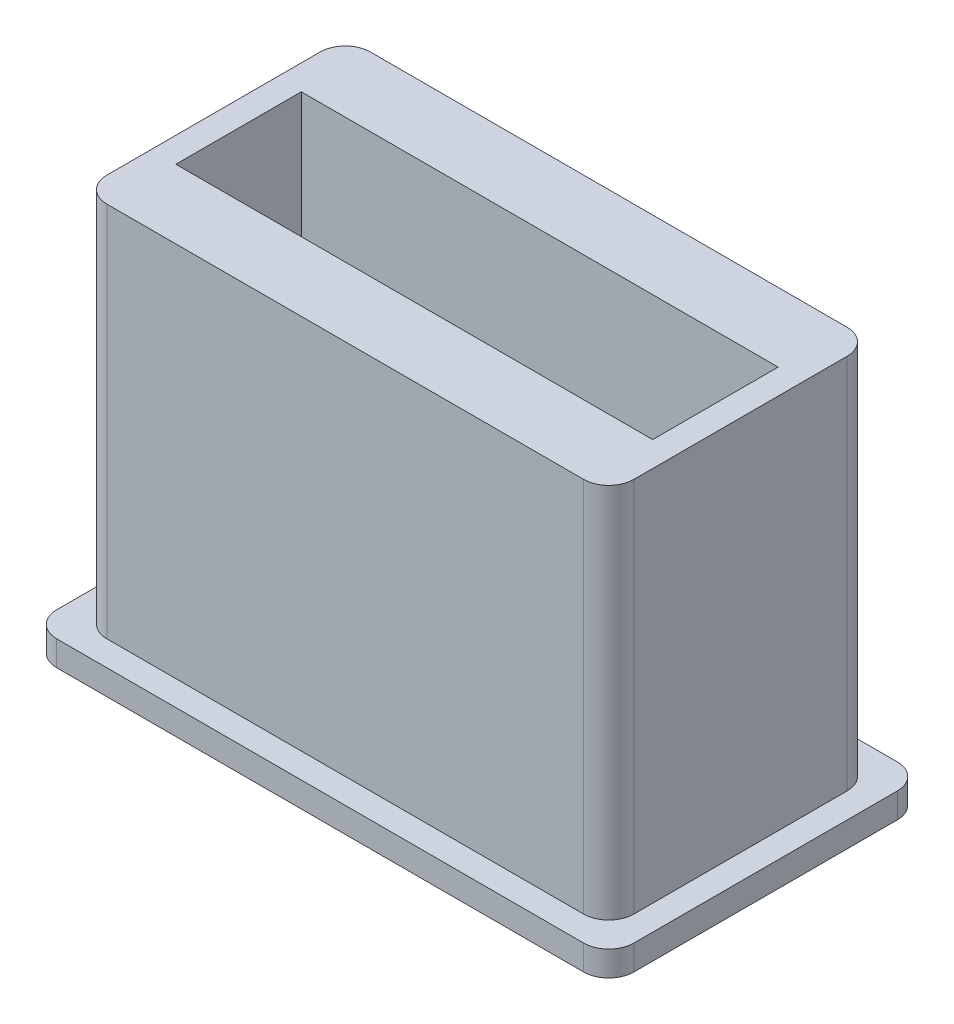
ISO-10303-21;
HEADER;
FILE_DESCRIPTION(('STEP AP214'),'2;1');
FILE_NAME('part.step','',(''),(''),'','','');
FILE_SCHEMA(('AUTOMOTIVE_DESIGN { 1 0 10303 214 1 1 1 1 }'));
ENDSEC;
DATA;
#1=APPLICATION_CONTEXT('core data for automotive mechanical design processes');
#2=APPLICATION_PROTOCOL_DEFINITION('international standard','automotive_design',2000,#1);
#3=PRODUCT_CONTEXT('',#1,'mechanical');
#4=PRODUCT('Part','Part','',(#3));
#5=PRODUCT_RELATED_PRODUCT_CATEGORY('part','',(#4));
#6=PRODUCT_DEFINITION_FORMATION('','',#4);
#7=PRODUCT_DEFINITION_CONTEXT('part definition',#1,'design');
#8=PRODUCT_DEFINITION('design','',#6,#7);
#9=PRODUCT_DEFINITION_SHAPE('','',#8);
#10=(LENGTH_UNIT() NAMED_UNIT(*) SI_UNIT(.MILLI.,.METRE.));
#11=(NAMED_UNIT(*) PLANE_ANGLE_UNIT() SI_UNIT($,.RADIAN.));
#12=(NAMED_UNIT(*) SI_UNIT($,.STERADIAN.) SOLID_ANGLE_UNIT());
#13=UNCERTAINTY_MEASURE_WITH_UNIT(LENGTH_MEASURE(1.E-05),#10,'distance_accuracy_value','');
#14=(GEOMETRIC_REPRESENTATION_CONTEXT(3) GLOBAL_UNCERTAINTY_ASSIGNED_CONTEXT((#13)) GLOBAL_UNIT_ASSIGNED_CONTEXT((#10,
#11,#12)) REPRESENTATION_CONTEXT('',''));
#15=CARTESIAN_POINT('',(0.,0.,0.));
#16=DIRECTION('',(0.,0.,1.));
#17=DIRECTION('',(1.,0.,0.));
#18=AXIS2_PLACEMENT_3D('',#15,#16,#17);
#19=CARTESIAN_POINT('',(0.,75.,0.));
#20=DIRECTION('',(0.,1.,0.));
#21=DIRECTION('',(0.,0.,1.));
#22=AXIS2_PLACEMENT_3D('',#19,#20,#21);
#23=PLANE('',#22);
#24=DIRECTION('',(-1.,0.,0.));
#25=VECTOR('',#24,1.);
#26=CARTESIAN_POINT('',(5.,75.,-16.1));
#27=LINE('',#26,#25);
#28=CARTESIAN_POINT('',(5.,75.,-16.1));
#29=VERTEX_POINT('',#28);
#30=CARTESIAN_POINT('',(-5.,75.,-16.1));
#31=VERTEX_POINT('',#30);
#32=EDGE_CURVE('E11',#29,#31,#27,.T.);
#33=ORIENTED_EDGE('',*,*,#32,.F.);
#34=DIRECTION('',(0.,0.,-1.));
#35=VECTOR('',#34,1.);
#36=CARTESIAN_POINT('',(5.,75.,-25.));
#37=LINE('',#36,#35);
#38=CARTESIAN_POINT('',(5.,75.,-25.));
#39=VERTEX_POINT('',#38);
#40=EDGE_CURVE('E229',#29,#39,#37,.T.);
#41=ORIENTED_EDGE('',*,*,#40,.T.);
#42=DIRECTION('',(-1.,0.,0.));
#43=VECTOR('',#42,1.);
#44=CARTESIAN_POINT('',(-5.,75.,-25.));
#45=LINE('',#44,#43);
#46=CARTESIAN_POINT('',(-5.,75.,-25.));
#47=VERTEX_POINT('',#46);
#48=EDGE_CURVE('E217',#39,#47,#45,.T.);
#49=ORIENTED_EDGE('',*,*,#48,.T.);
#50=DIRECTION('',(0.,0.,1.));
#51=VECTOR('',#50,1.);
#52=CARTESIAN_POINT('',(-5.,75.,-25.));
#53=LINE('',#52,#51);
#54=EDGE_CURVE('E212',#47,#31,#53,.T.);
#55=ORIENTED_EDGE('',*,*,#54,.T.);
#56=EDGE_LOOP('',(#33,#41,#49,#55));
#57=FACE_BOUND('',#56,.T.);
#58=ADVANCED_FACE('F33',(#57),#23,.T.);
#59=CARTESIAN_POINT('',(95.,150.,25.));
#60=DIRECTION('',(0.,0.,-1.));
#61=DIRECTION('',(-1.,0.,0.));
#62=AXIS2_PLACEMENT_3D('',#59,#60,#61);
#63=PLANE('',#62);
#64=DIRECTION('',(1.,0.,0.));
#65=VECTOR('',#64,1.);
#66=CARTESIAN_POINT('',(95.,0.,25.));
#67=LINE('',#66,#65);
#68=CARTESIAN_POINT('',(5.,0.,25.));
#69=VERTEX_POINT('',#68);
#70=CARTESIAN_POINT('',(95.,0.,25.));
#71=VERTEX_POINT('',#70);
#72=EDGE_CURVE('E280',#69,#71,#67,.T.);
#73=ORIENTED_EDGE('',*,*,#72,.F.);
#74=DIRECTION('',(0.,-1.,0.));
#75=VECTOR('',#74,1.);
#76=CARTESIAN_POINT('',(5.,75.,25.));
#77=LINE('',#76,#75);
#78=CARTESIAN_POINT('',(5.,75.,25.));
#79=VERTEX_POINT('',#78);
#80=EDGE_CURVE('E220',#79,#69,#77,.T.);
#81=ORIENTED_EDGE('',*,*,#80,.F.);
#82=DIRECTION('',(1.,0.,0.));
#83=VECTOR('',#82,1.);
#84=CARTESIAN_POINT('',(-5.,75.,25.));
#85=LINE('',#84,#83);
#86=CARTESIAN_POINT('',(-5.,75.,25.));
#87=VERTEX_POINT('',#86);
#88=EDGE_CURVE('E218',#87,#79,#85,.T.);
#89=ORIENTED_EDGE('',*,*,#88,.F.);
#90=DIRECTION('',(0.,-1.,0.));
#91=VECTOR('',#90,1.);
#92=CARTESIAN_POINT('',(-5.,75.,25.));
#93=LINE('',#92,#91);
#94=CARTESIAN_POINT('',(-5.,0.,25.));
#95=VERTEX_POINT('',#94);
#96=EDGE_CURVE('E231',#87,#95,#93,.T.);
#97=ORIENTED_EDGE('',*,*,#96,.T.);
#98=CARTESIAN_POINT('',(-95.,0.,25.));
#99=VERTEX_POINT('',#98);
#100=EDGE_CURVE('E281',#99,#95,#67,.T.);
#101=ORIENTED_EDGE('',*,*,#100,.F.);
#102=DIRECTION('',(0.,-1.,0.));
#103=VECTOR('',#102,1.);
#104=CARTESIAN_POINT('',(-95.,150.,25.));
#105=LINE('',#104,#103);
#106=CARTESIAN_POINT('',(-95.,150.,25.));
#107=VERTEX_POINT('',#106);
#108=EDGE_CURVE('E297',#107,#99,#105,.T.);
#109=ORIENTED_EDGE('',*,*,#108,.F.);
#110=DIRECTION('',(1.,0.,0.));
#111=VECTOR('',#110,1.);
#112=CARTESIAN_POINT('',(95.,150.,25.));
#113=LINE('',#112,#111);
#114=CARTESIAN_POINT('',(95.,150.,25.));
#115=VERTEX_POINT('',#114);
#116=EDGE_CURVE('E269',#107,#115,#113,.T.);
#117=ORIENTED_EDGE('',*,*,#116,.T.);
#118=DIRECTION('',(0.,-1.,0.));
#119=VECTOR('',#118,1.);
#120=CARTESIAN_POINT('',(95.,150.,25.));
#121=LINE('',#120,#119);
#122=EDGE_CURVE('E294',#115,#71,#121,.T.);
#123=ORIENTED_EDGE('',*,*,#122,.T.);
#124=EDGE_LOOP('',(#73,#81,#89,#97,#101,#109,#117,#123));
#125=FACE_BOUND('',#124,.T.);
#126=ADVANCED_FACE('F429',(#125),#63,.T.);
#127=CARTESIAN_POINT('',(95.,150.,-25.));
#128=DIRECTION('',(0.,0.,1.));
#129=DIRECTION('',(1.,0.,0.));
#130=AXIS2_PLACEMENT_3D('',#127,#128,#129);
#131=PLANE('',#130);
#132=ORIENTED_EDGE('',*,*,#48,.F.);
#133=DIRECTION('',(0.,-1.,0.));
#134=VECTOR('',#133,1.);
#135=CARTESIAN_POINT('',(5.,75.,-25.));
#136=LINE('',#135,#134);
#137=CARTESIAN_POINT('',(5.,0.,-25.));
#138=VERTEX_POINT('',#137);
#139=EDGE_CURVE('E235',#39,#138,#136,.T.);
#140=ORIENTED_EDGE('',*,*,#139,.T.);
#141=DIRECTION('',(-1.,0.,0.));
#142=VECTOR('',#141,1.);
#143=CARTESIAN_POINT('',(95.,0.,-25.));
#144=LINE('',#143,#142);
#145=CARTESIAN_POINT('',(95.,0.,-25.));
#146=VERTEX_POINT('',#145);
#147=EDGE_CURVE('E270',#146,#138,#144,.T.);
#148=ORIENTED_EDGE('',*,*,#147,.F.);
#149=DIRECTION('',(0.,-1.,0.));
#150=VECTOR('',#149,1.);
#151=CARTESIAN_POINT('',(95.,150.,-25.));
#152=LINE('',#151,#150);
#153=CARTESIAN_POINT('',(95.,150.,-25.));
#154=VERTEX_POINT('',#153);
#155=EDGE_CURVE('E292',#154,#146,#152,.T.);
#156=ORIENTED_EDGE('',*,*,#155,.F.);
#157=DIRECTION('',(-1.,0.,0.));
#158=VECTOR('',#157,1.);
#159=CARTESIAN_POINT('',(95.,150.,-25.));
#160=LINE('',#159,#158);
#161=CARTESIAN_POINT('',(-95.,150.,-25.));
#162=VERTEX_POINT('',#161);
#163=EDGE_CURVE('E275',#154,#162,#160,.T.);
#164=ORIENTED_EDGE('',*,*,#163,.T.);
#165=DIRECTION('',(0.,-1.,0.));
#166=VECTOR('',#165,1.);
#167=CARTESIAN_POINT('',(-95.,150.,-25.));
#168=LINE('',#167,#166);
#169=CARTESIAN_POINT('',(-95.,0.,-25.));
#170=VERTEX_POINT('',#169);
#171=EDGE_CURVE('E277',#162,#170,#168,.T.);
#172=ORIENTED_EDGE('',*,*,#171,.T.);
#173=CARTESIAN_POINT('',(-5.,0.,-25.));
#174=VERTEX_POINT('',#173);
#175=EDGE_CURVE('E287',#174,#170,#144,.T.);
#176=ORIENTED_EDGE('',*,*,#175,.F.);
#177=DIRECTION('',(0.,-1.,0.));
#178=VECTOR('',#177,1.);
#179=CARTESIAN_POINT('',(-5.,75.,-25.));
#180=LINE('',#179,#178);
#181=EDGE_CURVE('E55',#47,#174,#180,.T.);
#182=ORIENTED_EDGE('',*,*,#181,.F.);
#183=EDGE_LOOP('',(#132,#140,#148,#156,#164,#172,#176,#182));
#184=FACE_BOUND('',#183,.T.);
#185=ADVANCED_FACE('F421',(#184),#131,.T.);
#186=CARTESIAN_POINT('',(0.,0.,0.));
#187=DIRECTION('',(0.,1.,0.));
#188=DIRECTION('',(0.,0.,1.));
#189=AXIS2_PLACEMENT_3D('',#186,#187,#188);
#190=PLANE('',#189);
#191=ORIENTED_EDGE('',*,*,#147,.T.);
#192=DIRECTION('',(0.,0.,-1.));
#193=VECTOR('',#192,1.);
#194=CARTESIAN_POINT('',(5.,0.,-25.));
#195=LINE('',#194,#193);
#196=EDGE_CURVE('E225',#69,#138,#195,.T.);
#197=ORIENTED_EDGE('',*,*,#196,.F.);
#198=ORIENTED_EDGE('',*,*,#72,.T.);
#199=DIRECTION('',(0.,0.,-1.));
#200=VECTOR('',#199,1.);
#201=CARTESIAN_POINT('',(95.,0.,25.));
#202=LINE('',#201,#200);
#203=EDGE_CURVE('E284',#71,#146,#202,.T.);
#204=ORIENTED_EDGE('',*,*,#203,.T.);
#205=EDGE_LOOP('',(#191,#197,#198,#204));
#206=FACE_BOUND('',#205,.T.);
#207=ADVANCED_FACE('F432',(#206),#190,.T.);
#208=ORIENTED_EDGE('',*,*,#100,.T.);
#209=DIRECTION('',(0.,0.,1.));
#210=VECTOR('',#209,1.);
#211=CARTESIAN_POINT('',(-5.,0.,-25.));
#212=LINE('',#211,#210);
#213=EDGE_CURVE('E227',#174,#95,#212,.T.);
#214=ORIENTED_EDGE('',*,*,#213,.F.);
#215=ORIENTED_EDGE('',*,*,#175,.T.);
#216=DIRECTION('',(0.,0.,1.));
#217=VECTOR('',#216,1.);
#218=CARTESIAN_POINT('',(-95.,0.,25.));
#219=LINE('',#218,#217);
#220=EDGE_CURVE('E264',#170,#99,#219,.T.);
#221=ORIENTED_EDGE('',*,*,#220,.T.);
#222=EDGE_LOOP('',(#208,#214,#215,#221));
#223=FACE_BOUND('',#222,.T.);
#224=ADVANCED_FACE('F426',(#223),#190,.T.);
#225=CARTESIAN_POINT('',(-105.,-10.,52.5));
#226=DIRECTION('',(0.,1.,0.));
#227=DIRECTION('',(0.,0.,1.));
#228=AXIS2_PLACEMENT_3D('',#225,#226,#227);
#229=CYLINDRICAL_SURFACE('',#228,10.);
#230=DIRECTION('',(0.,1.,0.));
#231=VECTOR('',#230,1.);
#232=CARTESIAN_POINT('',(-115.,-10.,52.5));
#233=LINE('',#232,#231);
#234=CARTESIAN_POINT('',(-115.,-10.,52.5));
#235=VERTEX_POINT('',#234);
#236=CARTESIAN_POINT('',(-115.,0.,52.5));
#237=VERTEX_POINT('',#236);
#238=EDGE_CURVE('E398',#235,#237,#233,.T.);
#239=ORIENTED_EDGE('',*,*,#238,.F.);
#240=CARTESIAN_POINT('',(-105.,-10.,52.5));
#241=DIRECTION('',(0.,1.,0.));
#242=DIRECTION('',(0.,0.,1.));
#243=AXIS2_PLACEMENT_3D('',#240,#241,#242);
#244=CIRCLE('',#243,10.);
#245=CARTESIAN_POINT('',(-105.,-10.,62.5));
#246=VERTEX_POINT('',#245);
#247=EDGE_CURVE('E404',#246,#235,#244,.F.);
#248=ORIENTED_EDGE('',*,*,#247,.F.);
#249=DIRECTION('',(0.,1.,0.));
#250=VECTOR('',#249,1.);
#251=CARTESIAN_POINT('',(-105.,-10.,62.5));
#252=LINE('',#251,#250);
#253=CARTESIAN_POINT('',(-105.,0.,62.5));
#254=VERTEX_POINT('',#253);
#255=EDGE_CURVE('E401',#254,#246,#252,.F.);
#256=ORIENTED_EDGE('',*,*,#255,.F.);
#257=CARTESIAN_POINT('',(-105.,0.,52.5));
#258=DIRECTION('',(0.,1.,0.));
#259=DIRECTION('',(0.,0.,1.));
#260=AXIS2_PLACEMENT_3D('',#257,#258,#259);
#261=CIRCLE('',#260,10.);
#262=EDGE_CURVE('E406',#237,#254,#261,.T.);
#263=ORIENTED_EDGE('',*,*,#262,.F.);
#264=EDGE_LOOP('',(#239,#248,#256,#263));
#265=FACE_BOUND('',#264,.T.);
#266=ADVANCED_FACE('F35',(#265),#229,.T.);
#267=CARTESIAN_POINT('',(-105.,-10.,-52.5));
#268=DIRECTION('',(0.,1.,0.));
#269=DIRECTION('',(0.,0.,1.));
#270=AXIS2_PLACEMENT_3D('',#267,#268,#269);
#271=CYLINDRICAL_SURFACE('',#270,10.);
#272=DIRECTION('',(0.,1.,0.));
#273=VECTOR('',#272,1.);
#274=CARTESIAN_POINT('',(-105.,-10.,-62.5));
#275=LINE('',#274,#273);
#276=CARTESIAN_POINT('',(-105.,-10.,-62.5));
#277=VERTEX_POINT('',#276);
#278=CARTESIAN_POINT('',(-105.,0.,-62.5));
#279=VERTEX_POINT('',#278);
#280=EDGE_CURVE('E388',#277,#279,#275,.T.);
#281=ORIENTED_EDGE('',*,*,#280,.F.);
#282=CARTESIAN_POINT('',(-105.,-10.,-52.5));
#283=DIRECTION('',(0.,1.,0.));
#284=DIRECTION('',(0.,0.,1.));
#285=AXIS2_PLACEMENT_3D('',#282,#283,#284);
#286=CIRCLE('',#285,10.);
#287=CARTESIAN_POINT('',(-115.,-10.,-52.5));
#288=VERTEX_POINT('',#287);
#289=EDGE_CURVE('E394',#288,#277,#286,.F.);
#290=ORIENTED_EDGE('',*,*,#289,.F.);
#291=DIRECTION('',(0.,1.,0.));
#292=VECTOR('',#291,1.);
#293=CARTESIAN_POINT('',(-115.,-10.,-52.5));
#294=LINE('',#293,#292);
#295=CARTESIAN_POINT('',(-115.,0.,-52.5));
#296=VERTEX_POINT('',#295);
#297=EDGE_CURVE('E391',#296,#288,#294,.F.);
#298=ORIENTED_EDGE('',*,*,#297,.F.);
#299=CARTESIAN_POINT('',(-105.,0.,-52.5));
#300=DIRECTION('',(0.,1.,0.));
#301=DIRECTION('',(0.,0.,1.));
#302=AXIS2_PLACEMENT_3D('',#299,#300,#301);
#303=CIRCLE('',#302,10.);
#304=EDGE_CURVE('E396',#279,#296,#303,.T.);
#305=ORIENTED_EDGE('',*,*,#304,.F.);
#306=EDGE_LOOP('',(#281,#290,#298,#305));
#307=FACE_BOUND('',#306,.T.);
#308=ADVANCED_FACE('F523',(#307),#271,.T.);
#309=CARTESIAN_POINT('',(105.,-10.,-52.5));
#310=DIRECTION('',(0.,1.,0.));
#311=DIRECTION('',(0.,0.,1.));
#312=AXIS2_PLACEMENT_3D('',#309,#310,#311);
#313=CYLINDRICAL_SURFACE('',#312,10.);
#314=DIRECTION('',(0.,1.,0.));
#315=VECTOR('',#314,1.);
#316=CARTESIAN_POINT('',(115.,-10.,-52.5));
#317=LINE('',#316,#315);
#318=CARTESIAN_POINT('',(115.,-10.,-52.5));
#319=VERTEX_POINT('',#318);
#320=CARTESIAN_POINT('',(115.,0.,-52.5));
#321=VERTEX_POINT('',#320);
#322=EDGE_CURVE('E378',#319,#321,#317,.T.);
#323=ORIENTED_EDGE('',*,*,#322,.F.);
#324=CARTESIAN_POINT('',(105.,-10.,-52.5));
#325=DIRECTION('',(0.,1.,0.));
#326=DIRECTION('',(0.,0.,1.));
#327=AXIS2_PLACEMENT_3D('',#324,#325,#326);
#328=CIRCLE('',#327,10.);
#329=CARTESIAN_POINT('',(105.,-10.,-62.5));
#330=VERTEX_POINT('',#329);
#331=EDGE_CURVE('E384',#330,#319,#328,.F.);
#332=ORIENTED_EDGE('',*,*,#331,.F.);
#333=DIRECTION('',(0.,1.,0.));
#334=VECTOR('',#333,1.);
#335=CARTESIAN_POINT('',(105.,-10.,-62.5));
#336=LINE('',#335,#334);
#337=CARTESIAN_POINT('',(105.,0.,-62.5));
#338=VERTEX_POINT('',#337);
#339=EDGE_CURVE('E381',#338,#330,#336,.F.);
#340=ORIENTED_EDGE('',*,*,#339,.F.);
#341=CARTESIAN_POINT('',(105.,0.,-52.5));
#342=DIRECTION('',(0.,1.,0.));
#343=DIRECTION('',(0.,0.,1.));
#344=AXIS2_PLACEMENT_3D('',#341,#342,#343);
#345=CIRCLE('',#344,10.);
#346=EDGE_CURVE('E386',#321,#338,#345,.T.);
#347=ORIENTED_EDGE('',*,*,#346,.F.);
#348=EDGE_LOOP('',(#323,#332,#340,#347));
#349=FACE_BOUND('',#348,.T.);
#350=ADVANCED_FACE('F532',(#349),#313,.T.);
#351=CARTESIAN_POINT('',(105.,-10.,52.5));
#352=DIRECTION('',(0.,-1.,0.));
#353=DIRECTION('',(0.,0.,-1.));
#354=AXIS2_PLACEMENT_3D('',#351,#352,#353);
#355=CYLINDRICAL_SURFACE('',#354,10.);
#356=DIRECTION('',(0.,-1.,0.));
#357=VECTOR('',#356,1.);
#358=CARTESIAN_POINT('',(115.,-10.,52.5));
#359=LINE('',#358,#357);
#360=CARTESIAN_POINT('',(115.,0.,52.5));
#361=VERTEX_POINT('',#360);
#362=CARTESIAN_POINT('',(115.,-10.,52.5));
#363=VERTEX_POINT('',#362);
#364=EDGE_CURVE('E367',#361,#363,#359,.T.);
#365=ORIENTED_EDGE('',*,*,#364,.F.);
#366=CARTESIAN_POINT('',(105.,0.,52.5));
#367=DIRECTION('',(0.,1.,0.));
#368=DIRECTION('',(0.,0.,1.));
#369=AXIS2_PLACEMENT_3D('',#366,#367,#368);
#370=CIRCLE('',#369,10.);
#371=CARTESIAN_POINT('',(105.,0.,62.5));
#372=VERTEX_POINT('',#371);
#373=EDGE_CURVE('E373',#372,#361,#370,.T.);
#374=ORIENTED_EDGE('',*,*,#373,.F.);
#375=DIRECTION('',(0.,-1.,0.));
#376=VECTOR('',#375,1.);
#377=CARTESIAN_POINT('',(105.,-10.,62.5));
#378=LINE('',#377,#376);
#379=CARTESIAN_POINT('',(105.,-10.,62.5));
#380=VERTEX_POINT('',#379);
#381=EDGE_CURVE('E370',#380,#372,#378,.F.);
#382=ORIENTED_EDGE('',*,*,#381,.F.);
#383=CARTESIAN_POINT('',(105.,-10.,52.5));
#384=DIRECTION('',(0.,1.,0.));
#385=DIRECTION('',(0.,0.,1.));
#386=AXIS2_PLACEMENT_3D('',#383,#384,#385);
#387=CIRCLE('',#386,10.);
#388=EDGE_CURVE('E375',#363,#380,#387,.F.);
#389=ORIENTED_EDGE('',*,*,#388,.F.);
#390=EDGE_LOOP('',(#365,#374,#382,#389));
#391=FACE_BOUND('',#390,.T.);
#392=ADVANCED_FACE('F540',(#391),#355,.T.);
#393=CARTESIAN_POINT('',(94.9999999999999,150.,-42.5));
#394=DIRECTION('',(0.,1.,0.));
#395=DIRECTION('',(0.,0.,1.));
#396=AXIS2_PLACEMENT_3D('',#393,#394,#395);
#397=CYLINDRICAL_SURFACE('',#396,10.);
#398=DIRECTION('',(0.,1.,0.));
#399=VECTOR('',#398,1.);
#400=CARTESIAN_POINT('',(105.,150.,-42.5));
#401=LINE('',#400,#399);
#402=CARTESIAN_POINT('',(105.,0.,-42.5));
#403=VERTEX_POINT('',#402);
#404=CARTESIAN_POINT('',(105.,150.,-42.5));
#405=VERTEX_POINT('',#404);
#406=EDGE_CURVE('E356',#403,#405,#401,.T.);
#407=ORIENTED_EDGE('',*,*,#406,.F.);
#408=CARTESIAN_POINT('',(94.9999999999999,0.,-42.5));
#409=DIRECTION('',(0.,1.,0.));
#410=DIRECTION('',(0.,0.,1.));
#411=AXIS2_PLACEMENT_3D('',#408,#409,#410);
#412=CIRCLE('',#411,10.);
#413=CARTESIAN_POINT('',(94.9999999999999,0.,-52.5));
#414=VERTEX_POINT('',#413);
#415=EDGE_CURVE('E362',#414,#403,#412,.F.);
#416=ORIENTED_EDGE('',*,*,#415,.F.);
#417=DIRECTION('',(0.,1.,0.));
#418=VECTOR('',#417,1.);
#419=CARTESIAN_POINT('',(94.9999999999999,150.,-52.5));
#420=LINE('',#419,#418);
#421=CARTESIAN_POINT('',(94.9999999999999,150.,-52.5));
#422=VERTEX_POINT('',#421);
#423=EDGE_CURVE('E359',#422,#414,#420,.F.);
#424=ORIENTED_EDGE('',*,*,#423,.F.);
#425=CARTESIAN_POINT('',(94.9999999999999,150.,-42.5));
#426=DIRECTION('',(0.,1.,0.));
#427=DIRECTION('',(0.,0.,1.));
#428=AXIS2_PLACEMENT_3D('',#425,#426,#427);
#429=CIRCLE('',#428,10.);
#430=EDGE_CURVE('E365',#405,#422,#429,.T.);
#431=ORIENTED_EDGE('',*,*,#430,.F.);
#432=EDGE_LOOP('',(#407,#416,#424,#431));
#433=FACE_BOUND('',#432,.T.);
#434=ADVANCED_FACE('F548',(#433),#397,.T.);
#435=CARTESIAN_POINT('',(94.9999999999999,150.,42.5));
#436=DIRECTION('',(0.,1.,0.));
#437=DIRECTION('',(0.,0.,1.));
#438=AXIS2_PLACEMENT_3D('',#435,#436,#437);
#439=CYLINDRICAL_SURFACE('',#438,10.);
#440=DIRECTION('',(0.,1.,0.));
#441=VECTOR('',#440,1.);
#442=CARTESIAN_POINT('',(94.9999999999999,150.,52.5));
#443=LINE('',#442,#441);
#444=CARTESIAN_POINT('',(94.9999999999999,0.,52.5));
#445=VERTEX_POINT('',#444);
#446=CARTESIAN_POINT('',(94.9999999999999,150.,52.5));
#447=VERTEX_POINT('',#446);
#448=EDGE_CURVE('E345',#445,#447,#443,.T.);
#449=ORIENTED_EDGE('',*,*,#448,.F.);
#450=CARTESIAN_POINT('',(94.9999999999999,0.,42.5));
#451=DIRECTION('',(0.,1.,0.));
#452=DIRECTION('',(0.,0.,1.));
#453=AXIS2_PLACEMENT_3D('',#450,#451,#452);
#454=CIRCLE('',#453,10.);
#455=CARTESIAN_POINT('',(105.,0.,42.5));
#456=VERTEX_POINT('',#455);
#457=EDGE_CURVE('E351',#456,#445,#454,.F.);
#458=ORIENTED_EDGE('',*,*,#457,.F.);
#459=DIRECTION('',(0.,1.,0.));
#460=VECTOR('',#459,1.);
#461=CARTESIAN_POINT('',(105.,150.,42.5));
#462=LINE('',#461,#460);
#463=CARTESIAN_POINT('',(105.,150.,42.5));
#464=VERTEX_POINT('',#463);
#465=EDGE_CURVE('E348',#464,#456,#462,.F.);
#466=ORIENTED_EDGE('',*,*,#465,.F.);
#467=CARTESIAN_POINT('',(94.9999999999999,150.,42.5));
#468=DIRECTION('',(0.,1.,0.));
#469=DIRECTION('',(0.,0.,1.));
#470=AXIS2_PLACEMENT_3D('',#467,#468,#469);
#471=CIRCLE('',#470,10.);
#472=EDGE_CURVE('E354',#447,#464,#471,.T.);
#473=ORIENTED_EDGE('',*,*,#472,.F.);
#474=EDGE_LOOP('',(#449,#458,#466,#473));
#475=FACE_BOUND('',#474,.T.);
#476=ADVANCED_FACE('F557',(#475),#439,.T.);
#477=CARTESIAN_POINT('',(-95.0000000000001,150.,42.5));
#478=DIRECTION('',(0.,1.,0.));
#479=DIRECTION('',(0.,0.,1.));
#480=AXIS2_PLACEMENT_3D('',#477,#478,#479);
#481=CYLINDRICAL_SURFACE('',#480,10.);
#482=DIRECTION('',(0.,1.,0.));
#483=VECTOR('',#482,1.);
#484=CARTESIAN_POINT('',(-105.,150.,42.5));
#485=LINE('',#484,#483);
#486=CARTESIAN_POINT('',(-105.,0.,42.5));
#487=VERTEX_POINT('',#486);
#488=CARTESIAN_POINT('',(-105.,150.,42.5));
#489=VERTEX_POINT('',#488);
#490=EDGE_CURVE('E334',#487,#489,#485,.T.);
#491=ORIENTED_EDGE('',*,*,#490,.F.);
#492=CARTESIAN_POINT('',(-95.0000000000001,0.,42.5));
#493=DIRECTION('',(0.,1.,0.));
#494=DIRECTION('',(0.,0.,1.));
#495=AXIS2_PLACEMENT_3D('',#492,#493,#494);
#496=CIRCLE('',#495,10.);
#497=CARTESIAN_POINT('',(-95.0000000000001,0.,52.5));
#498=VERTEX_POINT('',#497);
#499=EDGE_CURVE('E340',#498,#487,#496,.F.);
#500=ORIENTED_EDGE('',*,*,#499,.F.);
#501=DIRECTION('',(0.,1.,0.));
#502=VECTOR('',#501,1.);
#503=CARTESIAN_POINT('',(-95.0000000000001,150.,52.5));
#504=LINE('',#503,#502);
#505=CARTESIAN_POINT('',(-95.0000000000001,150.,52.5));
#506=VERTEX_POINT('',#505);
#507=EDGE_CURVE('E337',#506,#498,#504,.F.);
#508=ORIENTED_EDGE('',*,*,#507,.F.);
#509=CARTESIAN_POINT('',(-95.0000000000001,150.,42.5));
#510=DIRECTION('',(0.,1.,0.));
#511=DIRECTION('',(0.,0.,1.));
#512=AXIS2_PLACEMENT_3D('',#509,#510,#511);
#513=CIRCLE('',#512,10.);
#514=EDGE_CURVE('E343',#489,#506,#513,.T.);
#515=ORIENTED_EDGE('',*,*,#514,.F.);
#516=EDGE_LOOP('',(#491,#500,#508,#515));
#517=FACE_BOUND('',#516,.T.);
#518=ADVANCED_FACE('F566',(#517),#481,.T.);
#519=CARTESIAN_POINT('',(-95.0000000000001,150.,-42.5));
#520=DIRECTION('',(0.,1.,0.));
#521=DIRECTION('',(0.,0.,1.));
#522=AXIS2_PLACEMENT_3D('',#519,#520,#521);
#523=CYLINDRICAL_SURFACE('',#522,10.);
#524=DIRECTION('',(0.,1.,0.));
#525=VECTOR('',#524,1.);
#526=CARTESIAN_POINT('',(-95.0000000000001,150.,-52.5));
#527=LINE('',#526,#525);
#528=CARTESIAN_POINT('',(-95.0000000000001,0.,-52.5));
#529=VERTEX_POINT('',#528);
#530=CARTESIAN_POINT('',(-95.0000000000001,150.,-52.5));
#531=VERTEX_POINT('',#530);
#532=EDGE_CURVE('E313',#529,#531,#527,.T.);
#533=ORIENTED_EDGE('',*,*,#532,.F.);
#534=CARTESIAN_POINT('',(-95.0000000000001,0.,-42.5));
#535=DIRECTION('',(0.,1.,0.));
#536=DIRECTION('',(0.,0.,1.));
#537=AXIS2_PLACEMENT_3D('',#534,#535,#536);
#538=CIRCLE('',#537,10.);
#539=CARTESIAN_POINT('',(-105.,0.,-42.5));
#540=VERTEX_POINT('',#539);
#541=EDGE_CURVE('E329',#540,#529,#538,.F.);
#542=ORIENTED_EDGE('',*,*,#541,.F.);
#543=DIRECTION('',(0.,1.,0.));
#544=VECTOR('',#543,1.);
#545=CARTESIAN_POINT('',(-105.,150.,-42.5));
#546=LINE('',#545,#544);
#547=CARTESIAN_POINT('',(-105.,150.,-42.5));
#548=VERTEX_POINT('',#547);
#549=EDGE_CURVE('E326',#548,#540,#546,.F.);
#550=ORIENTED_EDGE('',*,*,#549,.F.);
#551=CARTESIAN_POINT('',(-95.0000000000001,150.,-42.5));
#552=DIRECTION('',(0.,1.,0.));
#553=DIRECTION('',(0.,0.,1.));
#554=AXIS2_PLACEMENT_3D('',#551,#552,#553);
#555=CIRCLE('',#554,10.);
#556=EDGE_CURVE('E332',#531,#548,#555,.T.);
#557=ORIENTED_EDGE('',*,*,#556,.F.);
#558=EDGE_LOOP('',(#533,#542,#550,#557));
#559=FACE_BOUND('',#558,.T.);
#560=ADVANCED_FACE('F574',(#559),#523,.T.);
#561=CARTESIAN_POINT('',(0.,150.,0.));
#562=DIRECTION('',(0.,1.,0.));
#563=DIRECTION('',(0.,0.,1.));
#564=AXIS2_PLACEMENT_3D('',#561,#562,#563);
#565=PLANE('',#564);
#566=DIRECTION('',(0.,0.,-1.));
#567=VECTOR('',#566,1.);
#568=CARTESIAN_POINT('',(105.,150.,52.5));
#569=LINE('',#568,#567);
#570=EDGE_CURVE('E308',#464,#405,#569,.T.);
#571=ORIENTED_EDGE('',*,*,#570,.T.);
#572=ORIENTED_EDGE('',*,*,#430,.T.);
#573=DIRECTION('',(-1.,0.,0.));
#574=VECTOR('',#573,1.);
#575=CARTESIAN_POINT('',(105.,150.,-52.5));
#576=LINE('',#575,#574);
#577=EDGE_CURVE('E311',#422,#531,#576,.T.);
#578=ORIENTED_EDGE('',*,*,#577,.T.);
#579=ORIENTED_EDGE('',*,*,#556,.T.);
#580=DIRECTION('',(0.,0.,1.));
#581=VECTOR('',#580,1.);
#582=CARTESIAN_POINT('',(-105.,150.,52.5));
#583=LINE('',#582,#581);
#584=EDGE_CURVE('E301',#548,#489,#583,.T.);
#585=ORIENTED_EDGE('',*,*,#584,.T.);
#586=ORIENTED_EDGE('',*,*,#514,.T.);
#587=DIRECTION('',(1.,0.,0.));
#588=VECTOR('',#587,1.);
#589=CARTESIAN_POINT('',(105.,150.,52.5));
#590=LINE('',#589,#588);
#591=EDGE_CURVE('E304',#506,#447,#590,.T.);
#592=ORIENTED_EDGE('',*,*,#591,.T.);
#593=ORIENTED_EDGE('',*,*,#472,.T.);
#594=EDGE_LOOP('',(#571,#572,#578,#579,#585,#586,#592,#593));
#595=FACE_BOUND('',#594,.T.);
#596=ORIENTED_EDGE('',*,*,#116,.F.);
#597=DIRECTION('',(0.,0.,1.));
#598=VECTOR('',#597,1.);
#599=CARTESIAN_POINT('',(-95.,150.,25.));
#600=LINE('',#599,#598);
#601=EDGE_CURVE('E267',#162,#107,#600,.T.);
#602=ORIENTED_EDGE('',*,*,#601,.F.);
#603=ORIENTED_EDGE('',*,*,#163,.F.);
#604=DIRECTION('',(0.,0.,-1.));
#605=VECTOR('',#604,1.);
#606=CARTESIAN_POINT('',(95.,150.,25.));
#607=LINE('',#606,#605);
#608=EDGE_CURVE('E272',#115,#154,#607,.T.);
#609=ORIENTED_EDGE('',*,*,#608,.F.);
#610=EDGE_LOOP('',(#596,#602,#603,#609));
#611=FACE_BOUND('',#610,.T.);
#612=ADVANCED_FACE('F442',(#595,#611),#565,.T.);
#613=CARTESIAN_POINT('',(-105.,150.,52.5));
#614=DIRECTION('',(1.,0.,0.));
#615=DIRECTION('',(0.,0.,-1.));
#616=AXIS2_PLACEMENT_3D('',#613,#614,#615);
#617=PLANE('',#616);
#618=CARTESIAN_POINT('',(-105.,75.,0.));
#619=DIRECTION('',(-1.,0.,0.));
#620=DIRECTION('',(0.,0.,1.));
#621=AXIS2_PLACEMENT_3D('',#618,#619,#620);
#622=CIRCLE('',#621,16.1);
#623=CARTESIAN_POINT('',(-105.,75.,16.1));
#624=VERTEX_POINT('',#623);
#625=EDGE_CURVE('E251',#624,#624,#622,.T.);
#626=ORIENTED_EDGE('',*,*,#625,.F.);
#627=EDGE_LOOP('',(#626));
#628=FACE_BOUND('',#627,.T.);
#629=DIRECTION('',(0.,0.,1.));
#630=VECTOR('',#629,1.);
#631=CARTESIAN_POINT('',(-105.,0.,52.5));
#632=LINE('',#631,#630);
#633=EDGE_CURVE('E300',#540,#487,#632,.T.);
#634=ORIENTED_EDGE('',*,*,#633,.T.);
#635=ORIENTED_EDGE('',*,*,#490,.T.);
#636=ORIENTED_EDGE('',*,*,#584,.F.);
#637=ORIENTED_EDGE('',*,*,#549,.T.);
#638=EDGE_LOOP('',(#634,#635,#636,#637));
#639=FACE_BOUND('',#638,.T.);
#640=ADVANCED_FACE('F590',(#628,#639),#617,.F.);
#641=CARTESIAN_POINT('',(105.,150.,52.5));
#642=DIRECTION('',(0.,0.,-1.));
#643=DIRECTION('',(-1.,0.,0.));
#644=AXIS2_PLACEMENT_3D('',#641,#642,#643);
#645=PLANE('',#644);
#646=DIRECTION('',(1.,0.,0.));
#647=VECTOR('',#646,1.);
#648=CARTESIAN_POINT('',(105.,0.,52.5));
#649=LINE('',#648,#647);
#650=EDGE_CURVE('E316',#498,#445,#649,.T.);
#651=ORIENTED_EDGE('',*,*,#650,.T.);
#652=ORIENTED_EDGE('',*,*,#448,.T.);
#653=ORIENTED_EDGE('',*,*,#591,.F.);
#654=ORIENTED_EDGE('',*,*,#507,.T.);
#655=EDGE_LOOP('',(#651,#652,#653,#654));
#656=FACE_BOUND('',#655,.T.);
#657=ADVANCED_FACE('F596',(#656),#645,.F.);
#658=CARTESIAN_POINT('',(105.,150.,52.5));
#659=DIRECTION('',(-1.,0.,0.));
#660=DIRECTION('',(0.,0.,1.));
#661=AXIS2_PLACEMENT_3D('',#658,#659,#660);
#662=PLANE('',#661);
#663=DIRECTION('',(0.,0.,-1.));
#664=VECTOR('',#663,1.);
#665=CARTESIAN_POINT('',(105.,0.,52.5));
#666=LINE('',#665,#664);
#667=EDGE_CURVE('E319',#456,#403,#666,.T.);
#668=ORIENTED_EDGE('',*,*,#667,.T.);
#669=ORIENTED_EDGE('',*,*,#406,.T.);
#670=ORIENTED_EDGE('',*,*,#570,.F.);
#671=ORIENTED_EDGE('',*,*,#465,.T.);
#672=EDGE_LOOP('',(#668,#669,#670,#671));
#673=FACE_BOUND('',#672,.T.);
#674=ADVANCED_FACE('F455',(#673),#662,.F.);
#675=CARTESIAN_POINT('',(105.,150.,-52.5));
#676=DIRECTION('',(0.,0.,1.));
#677=DIRECTION('',(1.,0.,0.));
#678=AXIS2_PLACEMENT_3D('',#675,#676,#677);
#679=PLANE('',#678);
#680=ORIENTED_EDGE('',*,*,#577,.F.);
#681=ORIENTED_EDGE('',*,*,#423,.T.);
#682=DIRECTION('',(-1.,0.,0.));
#683=VECTOR('',#682,1.);
#684=CARTESIAN_POINT('',(105.,0.,-52.5));
#685=LINE('',#684,#683);
#686=EDGE_CURVE('E305',#414,#529,#685,.T.);
#687=ORIENTED_EDGE('',*,*,#686,.T.);
#688=ORIENTED_EDGE('',*,*,#532,.T.);
#689=EDGE_LOOP('',(#680,#681,#687,#688));
#690=FACE_BOUND('',#689,.T.);
#691=ADVANCED_FACE('F446',(#690),#679,.F.);
#692=CARTESIAN_POINT('',(-95.,150.,25.));
#693=DIRECTION('',(1.,0.,0.));
#694=DIRECTION('',(0.,0.,-1.));
#695=AXIS2_PLACEMENT_3D('',#692,#693,#694);
#696=PLANE('',#695);
#697=CARTESIAN_POINT('',(-95.0000000000001,75.,0.));
#698=DIRECTION('',(-1.,0.,0.));
#699=DIRECTION('',(0.,0.,1.));
#700=AXIS2_PLACEMENT_3D('',#697,#698,#699);
#701=CIRCLE('',#700,16.1);
#702=CARTESIAN_POINT('',(-95.0000000000001,75.,16.1));
#703=VERTEX_POINT('',#702);
#704=EDGE_CURVE('E261',#703,#703,#701,.T.);
#705=ORIENTED_EDGE('',*,*,#704,.T.);
#706=EDGE_LOOP('',(#705));
#707=FACE_BOUND('',#706,.T.);
#708=ORIENTED_EDGE('',*,*,#220,.F.);
#709=ORIENTED_EDGE('',*,*,#171,.F.);
#710=ORIENTED_EDGE('',*,*,#601,.T.);
#711=ORIENTED_EDGE('',*,*,#108,.T.);
#712=EDGE_LOOP('',(#708,#709,#710,#711));
#713=FACE_BOUND('',#712,.T.);
#714=ADVANCED_FACE('F444',(#707,#713),#696,.T.);
#715=CARTESIAN_POINT('',(95.,150.,25.));
#716=DIRECTION('',(-1.,0.,0.));
#717=DIRECTION('',(0.,0.,1.));
#718=AXIS2_PLACEMENT_3D('',#715,#716,#717);
#719=PLANE('',#718);
#720=ORIENTED_EDGE('',*,*,#203,.F.);
#721=ORIENTED_EDGE('',*,*,#122,.F.);
#722=ORIENTED_EDGE('',*,*,#608,.T.);
#723=ORIENTED_EDGE('',*,*,#155,.T.);
#724=EDGE_LOOP('',(#720,#721,#722,#723));
#725=FACE_BOUND('',#724,.T.);
#726=ADVANCED_FACE('F438',(#725),#719,.T.);
#727=CARTESIAN_POINT('',(-95.0000000000001,75.,0.));
#728=DIRECTION('',(-1.,0.,0.));
#729=DIRECTION('',(0.,0.,1.));
#730=AXIS2_PLACEMENT_3D('',#727,#728,#729);
#731=CYLINDRICAL_SURFACE('',#730,16.1);
#732=ORIENTED_EDGE('',*,*,#704,.F.);
#733=EDGE_LOOP('',(#732));
#734=FACE_BOUND('',#733,.T.);
#735=ORIENTED_EDGE('',*,*,#625,.T.);
#736=EDGE_LOOP('',(#735));
#737=FACE_BOUND('',#736,.T.);
#738=ADVANCED_FACE('F453',(#734,#737),#731,.F.);
#739=DIRECTION('',(0.,0.,1.));
#740=VECTOR('',#739,1.);
#741=CARTESIAN_POINT('',(-115.,0.,62.5));
#742=LINE('',#741,#740);
#743=EDGE_CURVE('E238',#296,#237,#742,.T.);
#744=ORIENTED_EDGE('',*,*,#743,.T.);
#745=ORIENTED_EDGE('',*,*,#262,.T.);
#746=DIRECTION('',(1.,0.,0.));
#747=VECTOR('',#746,1.);
#748=CARTESIAN_POINT('',(115.,0.,62.5));
#749=LINE('',#748,#747);
#750=EDGE_CURVE('E254',#254,#372,#749,.T.);
#751=ORIENTED_EDGE('',*,*,#750,.T.);
#752=ORIENTED_EDGE('',*,*,#373,.T.);
#753=DIRECTION('',(0.,0.,-1.));
#754=VECTOR('',#753,1.);
#755=CARTESIAN_POINT('',(115.,0.,62.5));
#756=LINE('',#755,#754);
#757=EDGE_CURVE('E256',#361,#321,#756,.T.);
#758=ORIENTED_EDGE('',*,*,#757,.T.);
#759=ORIENTED_EDGE('',*,*,#346,.T.);
#760=DIRECTION('',(-1.,0.,0.));
#761=VECTOR('',#760,1.);
#762=CARTESIAN_POINT('',(115.,0.,-62.5));
#763=LINE('',#762,#761);
#764=EDGE_CURVE('E243',#338,#279,#763,.T.);
#765=ORIENTED_EDGE('',*,*,#764,.T.);
#766=ORIENTED_EDGE('',*,*,#304,.T.);
#767=EDGE_LOOP('',(#744,#745,#751,#752,#758,#759,#765,#766));
#768=FACE_BOUND('',#767,.T.);
#769=ORIENTED_EDGE('',*,*,#686,.F.);
#770=ORIENTED_EDGE('',*,*,#415,.T.);
#771=ORIENTED_EDGE('',*,*,#667,.F.);
#772=ORIENTED_EDGE('',*,*,#457,.T.);
#773=ORIENTED_EDGE('',*,*,#650,.F.);
#774=ORIENTED_EDGE('',*,*,#499,.T.);
#775=ORIENTED_EDGE('',*,*,#633,.F.);
#776=ORIENTED_EDGE('',*,*,#541,.T.);
#777=EDGE_LOOP('',(#769,#770,#771,#772,#773,#774,#775,#776));
#778=FACE_BOUND('',#777,.T.);
#779=ADVANCED_FACE('F484',(#768,#778),#190,.T.);
#780=CARTESIAN_POINT('',(-115.,-10.,62.5));
#781=DIRECTION('',(-1.,0.,0.));
#782=DIRECTION('',(0.,0.,1.));
#783=AXIS2_PLACEMENT_3D('',#780,#781,#782);
#784=PLANE('',#783);
#785=DIRECTION('',(0.,0.,1.));
#786=VECTOR('',#785,1.);
#787=CARTESIAN_POINT('',(-115.,-10.,62.5));
#788=LINE('',#787,#786);
#789=EDGE_CURVE('E239',#288,#235,#788,.T.);
#790=ORIENTED_EDGE('',*,*,#789,.T.);
#791=ORIENTED_EDGE('',*,*,#238,.T.);
#792=ORIENTED_EDGE('',*,*,#743,.F.);
#793=ORIENTED_EDGE('',*,*,#297,.T.);
#794=EDGE_LOOP('',(#790,#791,#792,#793));
#795=FACE_BOUND('',#794,.T.);
#796=ADVANCED_FACE('F489',(#795),#784,.T.);
#797=CARTESIAN_POINT('',(115.,-10.,-62.5));
#798=DIRECTION('',(0.,0.,-1.));
#799=DIRECTION('',(-1.,0.,0.));
#800=AXIS2_PLACEMENT_3D('',#797,#798,#799);
#801=PLANE('',#800);
#802=DIRECTION('',(-1.,0.,0.));
#803=VECTOR('',#802,1.);
#804=CARTESIAN_POINT('',(115.,-10.,-62.5));
#805=LINE('',#804,#803);
#806=EDGE_CURVE('E248',#330,#277,#805,.T.);
#807=ORIENTED_EDGE('',*,*,#806,.T.);
#808=ORIENTED_EDGE('',*,*,#280,.T.);
#809=ORIENTED_EDGE('',*,*,#764,.F.);
#810=ORIENTED_EDGE('',*,*,#339,.T.);
#811=EDGE_LOOP('',(#807,#808,#809,#810));
#812=FACE_BOUND('',#811,.T.);
#813=ADVANCED_FACE('F485',(#812),#801,.T.);
#814=CARTESIAN_POINT('',(115.,-10.,62.5));
#815=DIRECTION('',(1.,0.,0.));
#816=DIRECTION('',(0.,0.,-1.));
#817=AXIS2_PLACEMENT_3D('',#814,#815,#816);
#818=PLANE('',#817);
#819=DIRECTION('',(0.,0.,-1.));
#820=VECTOR('',#819,1.);
#821=CARTESIAN_POINT('',(115.,-10.,62.5));
#822=LINE('',#821,#820);
#823=EDGE_CURVE('E245',#363,#319,#822,.T.);
#824=ORIENTED_EDGE('',*,*,#823,.T.);
#825=ORIENTED_EDGE('',*,*,#322,.T.);
#826=ORIENTED_EDGE('',*,*,#757,.F.);
#827=ORIENTED_EDGE('',*,*,#364,.T.);
#828=EDGE_LOOP('',(#824,#825,#826,#827));
#829=FACE_BOUND('',#828,.T.);
#830=ADVANCED_FACE('F488',(#829),#818,.T.);
#831=CARTESIAN_POINT('',(115.,-10.,62.5));
#832=DIRECTION('',(0.,0.,1.));
#833=DIRECTION('',(1.,0.,0.));
#834=AXIS2_PLACEMENT_3D('',#831,#832,#833);
#835=PLANE('',#834);
#836=ORIENTED_EDGE('',*,*,#750,.F.);
#837=ORIENTED_EDGE('',*,*,#255,.T.);
#838=DIRECTION('',(1.,0.,0.));
#839=VECTOR('',#838,1.);
#840=CARTESIAN_POINT('',(115.,-10.,62.5));
#841=LINE('',#840,#839);
#842=EDGE_CURVE('E242',#246,#380,#841,.T.);
#843=ORIENTED_EDGE('',*,*,#842,.T.);
#844=ORIENTED_EDGE('',*,*,#381,.T.);
#845=EDGE_LOOP('',(#836,#837,#843,#844));
#846=FACE_BOUND('',#845,.T.);
#847=ADVANCED_FACE('F480',(#846),#835,.T.);
#848=CARTESIAN_POINT('',(0.,-10.,0.));
#849=DIRECTION('',(0.,1.,0.));
#850=DIRECTION('',(0.,0.,1.));
#851=AXIS2_PLACEMENT_3D('',#848,#849,#850);
#852=PLANE('',#851);
#853=ORIENTED_EDGE('',*,*,#842,.F.);
#854=ORIENTED_EDGE('',*,*,#247,.T.);
#855=ORIENTED_EDGE('',*,*,#789,.F.);
#856=ORIENTED_EDGE('',*,*,#289,.T.);
#857=ORIENTED_EDGE('',*,*,#806,.F.);
#858=ORIENTED_EDGE('',*,*,#331,.T.);
#859=ORIENTED_EDGE('',*,*,#823,.F.);
#860=ORIENTED_EDGE('',*,*,#388,.T.);
#861=EDGE_LOOP('',(#853,#854,#855,#856,#857,#858,#859,#860));
#862=FACE_BOUND('',#861,.T.);
#863=ADVANCED_FACE('F475',(#862),#852,.F.);
#864=CARTESIAN_POINT('',(5.,75.,-25.));
#865=DIRECTION('',(-1.,0.,0.));
#866=DIRECTION('',(0.,0.,1.));
#867=AXIS2_PLACEMENT_3D('',#864,#865,#866);
#868=PLANE('',#867);
#869=ORIENTED_EDGE('',*,*,#40,.F.);
#870=CARTESIAN_POINT('',(5.,75.,0.));
#871=DIRECTION('',(-1.,0.,0.));
#872=DIRECTION('',(0.,0.,1.));
#873=AXIS2_PLACEMENT_3D('',#870,#871,#872);
#874=CIRCLE('',#873,16.1);
#875=CARTESIAN_POINT('',(5.,75.,16.1));
#876=VERTEX_POINT('',#875);
#877=EDGE_CURVE('E206',#29,#876,#874,.T.);
#878=ORIENTED_EDGE('',*,*,#877,.T.);
#879=EDGE_CURVE('E412',#79,#876,#37,.T.);
#880=ORIENTED_EDGE('',*,*,#879,.F.);
#881=ORIENTED_EDGE('',*,*,#80,.T.);
#882=ORIENTED_EDGE('',*,*,#196,.T.);
#883=ORIENTED_EDGE('',*,*,#139,.F.);
#884=EDGE_LOOP('',(#869,#878,#880,#881,#882,#883));
#885=FACE_BOUND('',#884,.T.);
#886=ADVANCED_FACE('F411',(#885),#868,.F.);
#887=CARTESIAN_POINT('',(-5.,75.,-25.));
#888=DIRECTION('',(1.,0.,0.));
#889=DIRECTION('',(0.,0.,-1.));
#890=AXIS2_PLACEMENT_3D('',#887,#888,#889);
#891=PLANE('',#890);
#892=CARTESIAN_POINT('',(-5.,75.,16.1));
#893=VERTEX_POINT('',#892);
#894=EDGE_CURVE('E214',#893,#87,#53,.T.);
#895=ORIENTED_EDGE('',*,*,#894,.F.);
#896=CARTESIAN_POINT('',(-5.,75.,0.));
#897=DIRECTION('',(-1.,0.,0.));
#898=DIRECTION('',(0.,0.,1.));
#899=AXIS2_PLACEMENT_3D('',#896,#897,#898);
#900=CIRCLE('',#899,16.1);
#901=EDGE_CURVE('E47',#31,#893,#900,.T.);
#902=ORIENTED_EDGE('',*,*,#901,.F.);
#903=ORIENTED_EDGE('',*,*,#54,.F.);
#904=ORIENTED_EDGE('',*,*,#181,.T.);
#905=ORIENTED_EDGE('',*,*,#213,.T.);
#906=ORIENTED_EDGE('',*,*,#96,.F.);
#907=EDGE_LOOP('',(#895,#902,#903,#904,#905,#906));
#908=FACE_BOUND('',#907,.T.);
#909=ADVANCED_FACE('F211',(#908),#891,.F.);
#910=DIRECTION('',(-1.,0.,0.));
#911=VECTOR('',#910,1.);
#912=CARTESIAN_POINT('',(5.,75.,16.1));
#913=LINE('',#912,#911);
#914=EDGE_CURVE('E41',#893,#876,#913,.F.);
#915=ORIENTED_EDGE('',*,*,#914,.F.);
#916=ORIENTED_EDGE('',*,*,#894,.T.);
#917=ORIENTED_EDGE('',*,*,#88,.T.);
#918=ORIENTED_EDGE('',*,*,#879,.T.);
#919=EDGE_LOOP('',(#915,#916,#917,#918));
#920=FACE_BOUND('',#919,.T.);
#921=ADVANCED_FACE('F416',(#920),#23,.T.);
#922=CARTESIAN_POINT('',(5.,75.,0.));
#923=DIRECTION('',(-1.,0.,0.));
#924=DIRECTION('',(0.,0.,1.));
#925=AXIS2_PLACEMENT_3D('',#922,#923,#924);
#926=CYLINDRICAL_SURFACE('',#925,16.1);
#927=ORIENTED_EDGE('',*,*,#32,.T.);
#928=ORIENTED_EDGE('',*,*,#901,.T.);
#929=ORIENTED_EDGE('',*,*,#914,.T.);
#930=ORIENTED_EDGE('',*,*,#877,.F.);
#931=EDGE_LOOP('',(#927,#928,#929,#930));
#932=FACE_BOUND('',#931,.T.);
#933=ADVANCED_FACE('F204',(#932),#926,.F.);
#934=CLOSED_SHELL('',(#58,#126,#185,#207,#224,#266,#308,#350,#392,#434,#476,#518,#560,#612,#640,
#657,#674,#691,#714,#726,#738,#779,#796,#813,#830,#847,#863,#886,#909,#921,#933));
#935=MANIFOLD_SOLID_BREP('B2',#934);
#936=ADVANCED_BREP_SHAPE_REPRESENTATION('',(#18,#935),#14);
#937=SHAPE_DEFINITION_REPRESENTATION(#9,#936);
ENDSEC;
END-ISO-10303-21;
